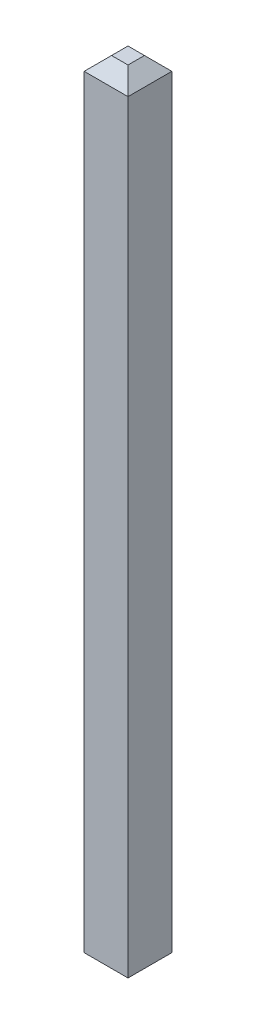
ISO-10303-21;
HEADER;
FILE_DESCRIPTION(('STEP AP214'),'2;1');
FILE_NAME('part.step','',(''),(''),'','','');
FILE_SCHEMA(('AUTOMOTIVE_DESIGN { 1 0 10303 214 1 1 1 1 }'));
ENDSEC;
DATA;
#1=APPLICATION_CONTEXT('core data for automotive mechanical design processes');
#2=APPLICATION_PROTOCOL_DEFINITION('international standard','automotive_design',2000,#1);
#3=PRODUCT_CONTEXT('',#1,'mechanical');
#4=PRODUCT('Part','Part','',(#3));
#5=PRODUCT_RELATED_PRODUCT_CATEGORY('part','',(#4));
#6=PRODUCT_DEFINITION_FORMATION('','',#4);
#7=PRODUCT_DEFINITION_CONTEXT('part definition',#1,'design');
#8=PRODUCT_DEFINITION('design','',#6,#7);
#9=PRODUCT_DEFINITION_SHAPE('','',#8);
#10=(LENGTH_UNIT() NAMED_UNIT(*) SI_UNIT(.MILLI.,.METRE.));
#11=(NAMED_UNIT(*) PLANE_ANGLE_UNIT() SI_UNIT($,.RADIAN.));
#12=(NAMED_UNIT(*) SI_UNIT($,.STERADIAN.) SOLID_ANGLE_UNIT());
#13=UNCERTAINTY_MEASURE_WITH_UNIT(LENGTH_MEASURE(1.E-05),#10,'distance_accuracy_value','');
#14=(GEOMETRIC_REPRESENTATION_CONTEXT(3) GLOBAL_UNCERTAINTY_ASSIGNED_CONTEXT((#13)) GLOBAL_UNIT_ASSIGNED_CONTEXT((#10,
#11,#12)) REPRESENTATION_CONTEXT('',''));
#15=CARTESIAN_POINT('',(0.,0.,0.));
#16=DIRECTION('',(0.,0.,1.));
#17=DIRECTION('',(1.,0.,0.));
#18=AXIS2_PLACEMENT_3D('',#15,#16,#17);
#19=CARTESIAN_POINT('',(-8.57,7.07,-0.32));
#20=DIRECTION('',(-0.707106781186548,-0.707106781186548,0.));
#21=DIRECTION('',(-0.707106781186548,0.707106781186548,0.));
#22=AXIS2_PLACEMENT_3D('',#19,#20,#21);
#23=PLANE('',#22);
#24=DIRECTION('',(0.577350269189626,-0.577350269189626,0.577350269189626));
#25=VECTOR('',#24,1.);
#26=CARTESIAN_POINT('',(-8.783333333333,7.283333333333,0.106666666667));
#27=LINE('',#26,#25);
#28=CARTESIAN_POINT('',(-8.77,7.27,0.12));
#29=VERTEX_POINT('',#28);
#30=CARTESIAN_POINT('',(-8.57,7.07,0.32));
#31=VERTEX_POINT('',#30);
#32=EDGE_CURVE('E58',#29,#31,#27,.T.);
#33=ORIENTED_EDGE('',*,*,#32,.T.);
#34=DIRECTION('',(0.,0.,1.));
#35=VECTOR('',#34,1.);
#36=CARTESIAN_POINT('',(-8.57,7.07,-0.32));
#37=LINE('',#36,#35);
#38=CARTESIAN_POINT('',(-8.57,7.07,-0.32));
#39=VERTEX_POINT('',#38);
#40=EDGE_CURVE('E179',#39,#31,#37,.T.);
#41=ORIENTED_EDGE('',*,*,#40,.F.);
#42=DIRECTION('',(0.577350269189626,-0.577350269189626,-0.577350269189626));
#43=VECTOR('',#42,1.);
#44=CARTESIAN_POINT('',(-8.57,7.07,-0.32));
#45=LINE('',#44,#43);
#46=CARTESIAN_POINT('',(-8.77,7.27,-0.12));
#47=VERTEX_POINT('',#46);
#48=EDGE_CURVE('E11',#47,#39,#45,.T.);
#49=ORIENTED_EDGE('',*,*,#48,.F.);
#50=DIRECTION('',(0.,0.,-1.));
#51=VECTOR('',#50,1.);
#52=CARTESIAN_POINT('',(-8.77,7.27,-0.32));
#53=LINE('',#52,#51);
#54=EDGE_CURVE('E176',#29,#47,#53,.T.);
#55=ORIENTED_EDGE('',*,*,#54,.F.);
#56=EDGE_LOOP('',(#33,#41,#49,#55));
#57=FACE_BOUND('',#56,.T.);
#58=ADVANCED_FACE('F16',(#57),#23,.F.);
#59=CARTESIAN_POINT('',(-8.89,7.07,-0.32));
#60=DIRECTION('',(0.,0.707106781186548,-0.707106781186548));
#61=DIRECTION('',(-1.,0.,0.));
#62=AXIS2_PLACEMENT_3D('',#59,#60,#61);
#63=PLANE('',#62);
#64=DIRECTION('',(0.577350269189626,0.577350269189626,0.577350269189626));
#65=VECTOR('',#64,1.);
#66=CARTESIAN_POINT('',(-9.076666666667,7.203333333333,-0.186666666667));
#67=LINE('',#66,#65);
#68=CARTESIAN_POINT('',(-9.21,7.07,-0.32));
#69=VERTEX_POINT('',#68);
#70=CARTESIAN_POINT('',(-9.01,7.27,-0.12));
#71=VERTEX_POINT('',#70);
#72=EDGE_CURVE('E27',#69,#71,#67,.T.);
#73=ORIENTED_EDGE('',*,*,#72,.T.);
#74=DIRECTION('',(-1.,0.,0.));
#75=VECTOR('',#74,1.);
#76=CARTESIAN_POINT('',(-9.21,7.27,-0.12));
#77=LINE('',#76,#75);
#78=EDGE_CURVE('E178',#47,#71,#77,.T.);
#79=ORIENTED_EDGE('',*,*,#78,.F.);
#80=ORIENTED_EDGE('',*,*,#48,.T.);
#81=DIRECTION('',(1.,0.,0.));
#82=VECTOR('',#81,1.);
#83=CARTESIAN_POINT('',(-8.57,7.07,-0.32));
#84=LINE('',#83,#82);
#85=EDGE_CURVE('E173',#69,#39,#84,.T.);
#86=ORIENTED_EDGE('',*,*,#85,.F.);
#87=EDGE_LOOP('',(#73,#79,#80,#86));
#88=FACE_BOUND('',#87,.T.);
#89=ADVANCED_FACE('F233',(#88),#63,.T.);
#90=CARTESIAN_POINT('',(-9.01,7.27,-0.32));
#91=DIRECTION('',(0.707106781186548,-0.707106781186548,0.));
#92=DIRECTION('',(0.,0.,-1.));
#93=AXIS2_PLACEMENT_3D('',#90,#91,#92);
#94=PLANE('',#93);
#95=DIRECTION('',(-0.577350269189626,-0.577350269189626,0.577350269189626));
#96=VECTOR('',#95,1.);
#97=CARTESIAN_POINT('',(-9.076666666667,7.203333333333,0.186666666667));
#98=LINE('',#97,#96);
#99=CARTESIAN_POINT('',(-9.01,7.27,0.12));
#100=VERTEX_POINT('',#99);
#101=CARTESIAN_POINT('',(-9.21,7.07,0.32));
#102=VERTEX_POINT('',#101);
#103=EDGE_CURVE('E41',#100,#102,#98,.T.);
#104=ORIENTED_EDGE('',*,*,#103,.F.);
#105=DIRECTION('',(0.,0.,1.));
#106=VECTOR('',#105,1.);
#107=CARTESIAN_POINT('',(-9.01,7.27,-0.32));
#108=LINE('',#107,#106);
#109=EDGE_CURVE('E184',#71,#100,#108,.T.);
#110=ORIENTED_EDGE('',*,*,#109,.F.);
#111=ORIENTED_EDGE('',*,*,#72,.F.);
#112=DIRECTION('',(0.,0.,-1.));
#113=VECTOR('',#112,1.);
#114=CARTESIAN_POINT('',(-9.21,7.07,-0.32));
#115=LINE('',#114,#113);
#116=EDGE_CURVE('E159',#102,#69,#115,.T.);
#117=ORIENTED_EDGE('',*,*,#116,.F.);
#118=EDGE_LOOP('',(#104,#110,#111,#117));
#119=FACE_BOUND('',#118,.T.);
#120=ADVANCED_FACE('F234',(#119),#94,.F.);
#121=CARTESIAN_POINT('',(-9.21,7.27,0.12));
#122=DIRECTION('',(0.,-0.707106781186548,-0.707106781186548));
#123=DIRECTION('',(0.,-0.707106781186548,0.707106781186548));
#124=AXIS2_PLACEMENT_3D('',#121,#122,#123);
#125=PLANE('',#124);
#126=ORIENTED_EDGE('',*,*,#32,.F.);
#127=DIRECTION('',(1.,0.,0.));
#128=VECTOR('',#127,1.);
#129=CARTESIAN_POINT('',(-9.21,7.27,0.12));
#130=LINE('',#129,#128);
#131=EDGE_CURVE('E209',#100,#29,#130,.T.);
#132=ORIENTED_EDGE('',*,*,#131,.F.);
#133=ORIENTED_EDGE('',*,*,#103,.T.);
#134=DIRECTION('',(-1.,0.,0.));
#135=VECTOR('',#134,1.);
#136=CARTESIAN_POINT('',(-8.89,7.07,0.32));
#137=LINE('',#136,#135);
#138=EDGE_CURVE('E163',#31,#102,#137,.T.);
#139=ORIENTED_EDGE('',*,*,#138,.F.);
#140=EDGE_LOOP('',(#126,#132,#133,#139));
#141=FACE_BOUND('',#140,.T.);
#142=ADVANCED_FACE('F236',(#141),#125,.F.);
#143=CARTESIAN_POINT('',(-9.21,7.27,-0.32));
#144=DIRECTION('',(0.,-1.,0.));
#145=DIRECTION('',(0.,0.,-1.));
#146=AXIS2_PLACEMENT_3D('',#143,#144,#145);
#147=PLANE('',#146);
#148=ORIENTED_EDGE('',*,*,#54,.T.);
#149=ORIENTED_EDGE('',*,*,#78,.T.);
#150=ORIENTED_EDGE('',*,*,#109,.T.);
#151=ORIENTED_EDGE('',*,*,#131,.T.);
#152=EDGE_LOOP('',(#148,#149,#150,#151));
#153=FACE_BOUND('',#152,.T.);
#154=ADVANCED_FACE('F231',(#153),#147,.F.);
#155=CARTESIAN_POINT('',(-8.57,7.27,-0.32));
#156=DIRECTION('',(-1.,0.,0.));
#157=DIRECTION('',(0.,1.,0.));
#158=AXIS2_PLACEMENT_3D('',#155,#156,#157);
#159=PLANE('',#158);
#160=DIRECTION('',(0.,-1.,0.));
#161=VECTOR('',#160,1.);
#162=CARTESIAN_POINT('',(-8.57,7.27,-0.32));
#163=LINE('',#162,#161);
#164=CARTESIAN_POINT('',(-8.57,-4.07,-0.32));
#165=VERTEX_POINT('',#164);
#166=EDGE_CURVE('E165',#39,#165,#163,.T.);
#167=ORIENTED_EDGE('',*,*,#166,.F.);
#168=ORIENTED_EDGE('',*,*,#40,.T.);
#169=DIRECTION('',(0.,-1.,0.));
#170=VECTOR('',#169,1.);
#171=CARTESIAN_POINT('',(-8.57,7.27,0.32));
#172=LINE('',#171,#170);
#173=CARTESIAN_POINT('',(-8.57,-4.07,0.32));
#174=VERTEX_POINT('',#173);
#175=EDGE_CURVE('E192',#31,#174,#172,.T.);
#176=ORIENTED_EDGE('',*,*,#175,.T.);
#177=DIRECTION('',(0.,0.,-1.));
#178=VECTOR('',#177,1.);
#179=CARTESIAN_POINT('',(-8.57,-4.07,-0.32));
#180=LINE('',#179,#178);
#181=EDGE_CURVE('E137',#174,#165,#180,.T.);
#182=ORIENTED_EDGE('',*,*,#181,.T.);
#183=EDGE_LOOP('',(#167,#168,#176,#182));
#184=FACE_BOUND('',#183,.T.);
#185=ADVANCED_FACE('F252',(#184),#159,.F.);
#186=CARTESIAN_POINT('',(-8.89,1.5,0.32));
#187=DIRECTION('',(0.,0.,-1.));
#188=DIRECTION('',(0.,-1.,0.));
#189=AXIS2_PLACEMENT_3D('',#186,#187,#188);
#190=PLANE('',#189);
#191=ORIENTED_EDGE('',*,*,#175,.F.);
#192=ORIENTED_EDGE('',*,*,#138,.T.);
#193=DIRECTION('',(0.,1.,0.));
#194=VECTOR('',#193,1.);
#195=CARTESIAN_POINT('',(-9.21,-4.27,0.32));
#196=LINE('',#195,#194);
#197=CARTESIAN_POINT('',(-9.21,-4.07,0.32));
#198=VERTEX_POINT('',#197);
#199=EDGE_CURVE('E154',#198,#102,#196,.T.);
#200=ORIENTED_EDGE('',*,*,#199,.F.);
#201=DIRECTION('',(1.,0.,0.));
#202=VECTOR('',#201,1.);
#203=CARTESIAN_POINT('',(-8.89,-4.07,0.32));
#204=LINE('',#203,#202);
#205=EDGE_CURVE('E128',#198,#174,#204,.T.);
#206=ORIENTED_EDGE('',*,*,#205,.T.);
#207=EDGE_LOOP('',(#191,#192,#200,#206));
#208=FACE_BOUND('',#207,.T.);
#209=ADVANCED_FACE('F162',(#208),#190,.F.);
#210=CARTESIAN_POINT('',(-8.77,-4.27,-0.32));
#211=DIRECTION('',(-0.707106781186548,0.707106781186548,0.));
#212=DIRECTION('',(0.,0.,1.));
#213=AXIS2_PLACEMENT_3D('',#210,#211,#212);
#214=PLANE('',#213);
#215=DIRECTION('',(-0.577350269189626,-0.577350269189626,0.577350269189626));
#216=VECTOR('',#215,1.);
#217=CARTESIAN_POINT('',(-8.703333333333,-4.203333333333,-0.186666666667));
#218=LINE('',#217,#216);
#219=CARTESIAN_POINT('',(-8.77,-4.27,-0.12));
#220=VERTEX_POINT('',#219);
#221=EDGE_CURVE('E92',#165,#220,#218,.T.);
#222=ORIENTED_EDGE('',*,*,#221,.F.);
#223=ORIENTED_EDGE('',*,*,#181,.F.);
#224=DIRECTION('',(-0.577350269189626,-0.577350269189626,-0.577350269189626));
#225=VECTOR('',#224,1.);
#226=CARTESIAN_POINT('',(-8.916666666667,-4.416666666667,-0.02666666666667));
#227=LINE('',#226,#225);
#228=CARTESIAN_POINT('',(-8.77,-4.27,0.12));
#229=VERTEX_POINT('',#228);
#230=EDGE_CURVE('E104',#174,#229,#227,.T.);
#231=ORIENTED_EDGE('',*,*,#230,.T.);
#232=DIRECTION('',(0.,0.,1.));
#233=VECTOR('',#232,1.);
#234=CARTESIAN_POINT('',(-8.77,-4.27,-0.32));
#235=LINE('',#234,#233);
#236=EDGE_CURVE('E190',#220,#229,#235,.T.);
#237=ORIENTED_EDGE('',*,*,#236,.F.);
#238=EDGE_LOOP('',(#222,#223,#231,#237));
#239=FACE_BOUND('',#238,.T.);
#240=ADVANCED_FACE('F251',(#239),#214,.F.);
#241=CARTESIAN_POINT('',(-8.57,-4.27,0.12));
#242=DIRECTION('',(0.,0.707106781186548,-0.707106781186548));
#243=DIRECTION('',(-1.,0.,0.));
#244=AXIS2_PLACEMENT_3D('',#241,#242,#243);
#245=PLANE('',#244);
#246=ORIENTED_EDGE('',*,*,#230,.F.);
#247=ORIENTED_EDGE('',*,*,#205,.F.);
#248=DIRECTION('',(-0.577350269189626,0.577350269189626,0.577350269189626));
#249=VECTOR('',#248,1.);
#250=CARTESIAN_POINT('',(-8.996666666667,-4.283333333333,0.106666666667));
#251=LINE('',#250,#249);
#252=CARTESIAN_POINT('',(-9.01,-4.27,0.12));
#253=VERTEX_POINT('',#252);
#254=EDGE_CURVE('E131',#253,#198,#251,.T.);
#255=ORIENTED_EDGE('',*,*,#254,.F.);
#256=DIRECTION('',(-1.,0.,0.));
#257=VECTOR('',#256,1.);
#258=CARTESIAN_POINT('',(-8.57,-4.27,0.12));
#259=LINE('',#258,#257);
#260=EDGE_CURVE('E187',#229,#253,#259,.T.);
#261=ORIENTED_EDGE('',*,*,#260,.F.);
#262=EDGE_LOOP('',(#246,#247,#255,#261));
#263=FACE_BOUND('',#262,.T.);
#264=ADVANCED_FACE('F130',(#263),#245,.F.);
#265=CARTESIAN_POINT('',(-9.21,-4.07,-0.32));
#266=DIRECTION('',(0.707106781186548,0.707106781186548,0.));
#267=DIRECTION('',(0.,0.,-1.));
#268=AXIS2_PLACEMENT_3D('',#265,#266,#267);
#269=PLANE('',#268);
#270=DIRECTION('',(0.577350269189626,-0.577350269189626,0.577350269189626));
#271=VECTOR('',#270,1.);
#272=CARTESIAN_POINT('',(-9.103333333333,-4.176666666667,-0.213333333333));
#273=LINE('',#272,#271);
#274=CARTESIAN_POINT('',(-9.21,-4.07,-0.32));
#275=VERTEX_POINT('',#274);
#276=CARTESIAN_POINT('',(-9.01,-4.27,-0.12));
#277=VERTEX_POINT('',#276);
#278=EDGE_CURVE('E199',#275,#277,#273,.T.);
#279=ORIENTED_EDGE('',*,*,#278,.T.);
#280=DIRECTION('',(0.,0.,-1.));
#281=VECTOR('',#280,1.);
#282=CARTESIAN_POINT('',(-9.01,-4.27,-0.32));
#283=LINE('',#282,#281);
#284=EDGE_CURVE('E147',#253,#277,#283,.T.);
#285=ORIENTED_EDGE('',*,*,#284,.F.);
#286=ORIENTED_EDGE('',*,*,#254,.T.);
#287=DIRECTION('',(0.,0.,1.));
#288=VECTOR('',#287,1.);
#289=CARTESIAN_POINT('',(-9.21,-4.07,-0.32));
#290=LINE('',#289,#288);
#291=EDGE_CURVE('E144',#275,#198,#290,.T.);
#292=ORIENTED_EDGE('',*,*,#291,.F.);
#293=EDGE_LOOP('',(#279,#285,#286,#292));
#294=FACE_BOUND('',#293,.T.);
#295=ADVANCED_FACE('F143',(#294),#269,.F.);
#296=CARTESIAN_POINT('',(-9.21,-4.27,-0.32));
#297=DIRECTION('',(1.,0.,0.));
#298=DIRECTION('',(0.,0.,1.));
#299=AXIS2_PLACEMENT_3D('',#296,#297,#298);
#300=PLANE('',#299);
#301=ORIENTED_EDGE('',*,*,#199,.T.);
#302=ORIENTED_EDGE('',*,*,#116,.T.);
#303=DIRECTION('',(0.,1.,0.));
#304=VECTOR('',#303,1.);
#305=CARTESIAN_POINT('',(-9.21,-4.27,-0.32));
#306=LINE('',#305,#304);
#307=EDGE_CURVE('E156',#275,#69,#306,.T.);
#308=ORIENTED_EDGE('',*,*,#307,.F.);
#309=ORIENTED_EDGE('',*,*,#291,.T.);
#310=EDGE_LOOP('',(#301,#302,#308,#309));
#311=FACE_BOUND('',#310,.T.);
#312=ADVANCED_FACE('F153',(#311),#300,.F.);
#313=CARTESIAN_POINT('',(-8.89,1.5,-0.32));
#314=DIRECTION('',(0.,0.,-1.));
#315=DIRECTION('',(0.,-1.,0.));
#316=AXIS2_PLACEMENT_3D('',#313,#314,#315);
#317=PLANE('',#316);
#318=ORIENTED_EDGE('',*,*,#307,.T.);
#319=ORIENTED_EDGE('',*,*,#85,.T.);
#320=ORIENTED_EDGE('',*,*,#166,.T.);
#321=DIRECTION('',(-1.,0.,0.));
#322=VECTOR('',#321,1.);
#323=CARTESIAN_POINT('',(-9.21,-4.07,-0.32));
#324=LINE('',#323,#322);
#325=EDGE_CURVE('E201',#165,#275,#324,.T.);
#326=ORIENTED_EDGE('',*,*,#325,.T.);
#327=EDGE_LOOP('',(#318,#319,#320,#326));
#328=FACE_BOUND('',#327,.T.);
#329=ADVANCED_FACE('F255',(#328),#317,.T.);
#330=CARTESIAN_POINT('',(-8.89,-4.07,-0.32));
#331=DIRECTION('',(0.,-0.707106781186548,-0.707106781186548));
#332=DIRECTION('',(0.,-0.707106781186548,0.707106781186548));
#333=AXIS2_PLACEMENT_3D('',#330,#331,#332);
#334=PLANE('',#333);
#335=ORIENTED_EDGE('',*,*,#278,.F.);
#336=ORIENTED_EDGE('',*,*,#325,.F.);
#337=ORIENTED_EDGE('',*,*,#221,.T.);
#338=DIRECTION('',(1.,0.,0.));
#339=VECTOR('',#338,1.);
#340=CARTESIAN_POINT('',(-8.57,-4.27,-0.12));
#341=LINE('',#340,#339);
#342=EDGE_CURVE('E20',#277,#220,#341,.T.);
#343=ORIENTED_EDGE('',*,*,#342,.F.);
#344=EDGE_LOOP('',(#335,#336,#337,#343));
#345=FACE_BOUND('',#344,.T.);
#346=ADVANCED_FACE('F18',(#345),#334,.T.);
#347=CARTESIAN_POINT('',(-8.57,-4.27,-0.32));
#348=DIRECTION('',(0.,1.,0.));
#349=DIRECTION('',(0.,0.,-1.));
#350=AXIS2_PLACEMENT_3D('',#347,#348,#349);
#351=PLANE('',#350);
#352=ORIENTED_EDGE('',*,*,#236,.T.);
#353=ORIENTED_EDGE('',*,*,#260,.T.);
#354=ORIENTED_EDGE('',*,*,#284,.T.);
#355=ORIENTED_EDGE('',*,*,#342,.T.);
#356=EDGE_LOOP('',(#352,#353,#354,#355));
#357=FACE_BOUND('',#356,.T.);
#358=ADVANCED_FACE('F268',(#357),#351,.F.);
#359=CLOSED_SHELL('',(#58,#89,#120,#142,#154,#185,#209,#240,#264,#295,#312,#329,#346,#358));
#360=MANIFOLD_SOLID_BREP('B1',#359);
#361=ADVANCED_BREP_SHAPE_REPRESENTATION('',(#18,#360),#14);
#362=SHAPE_DEFINITION_REPRESENTATION(#9,#361);
ENDSEC;
END-ISO-10303-21;
